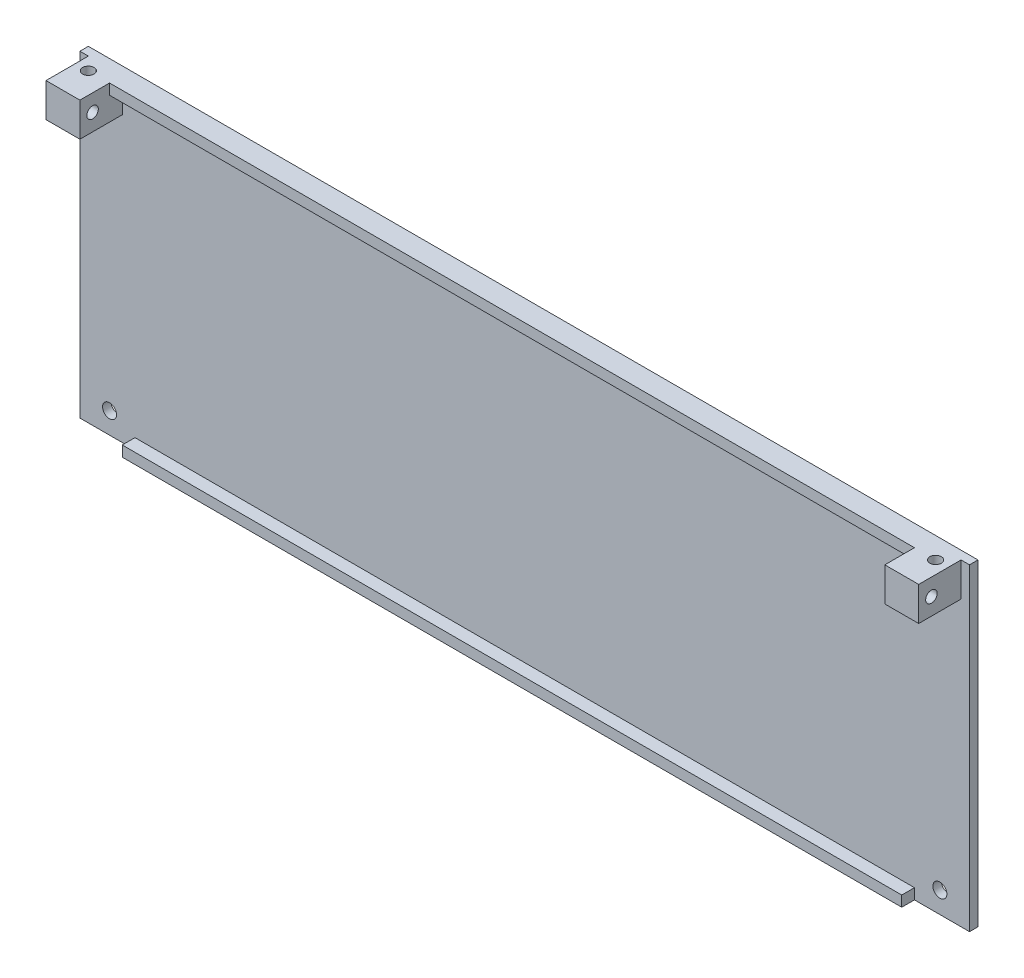
ISO-10303-21;
HEADER;
FILE_DESCRIPTION(('STEP AP214'),'2;1');
FILE_NAME('part.step','',(''),(''),'','','');
FILE_SCHEMA(('AUTOMOTIVE_DESIGN { 1 0 10303 214 1 1 1 1 }'));
ENDSEC;
DATA;
#1=APPLICATION_CONTEXT('core data for automotive mechanical design processes');
#2=APPLICATION_PROTOCOL_DEFINITION('international standard','automotive_design',2000,#1);
#3=PRODUCT_CONTEXT('',#1,'mechanical');
#4=PRODUCT('Part','Part','',(#3));
#5=PRODUCT_RELATED_PRODUCT_CATEGORY('part','',(#4));
#6=PRODUCT_DEFINITION_FORMATION('','',#4);
#7=PRODUCT_DEFINITION_CONTEXT('part definition',#1,'design');
#8=PRODUCT_DEFINITION('design','',#6,#7);
#9=PRODUCT_DEFINITION_SHAPE('','',#8);
#10=(LENGTH_UNIT() NAMED_UNIT(*) SI_UNIT(.MILLI.,.METRE.));
#11=(NAMED_UNIT(*) PLANE_ANGLE_UNIT() SI_UNIT($,.RADIAN.));
#12=(NAMED_UNIT(*) SI_UNIT($,.STERADIAN.) SOLID_ANGLE_UNIT());
#13=UNCERTAINTY_MEASURE_WITH_UNIT(LENGTH_MEASURE(1.E-05),#10,'distance_accuracy_value','');
#14=(GEOMETRIC_REPRESENTATION_CONTEXT(3) GLOBAL_UNCERTAINTY_ASSIGNED_CONTEXT((#13)) GLOBAL_UNIT_ASSIGNED_CONTEXT((#10,
#11,#12)) REPRESENTATION_CONTEXT('',''));
#15=CARTESIAN_POINT('',(0.,0.,0.));
#16=DIRECTION('',(0.,0.,1.));
#17=DIRECTION('',(1.,0.,0.));
#18=AXIS2_PLACEMENT_3D('',#15,#16,#17);
#19=CARTESIAN_POINT('',(0.,0.,2.));
#20=DIRECTION('',(0.,0.,1.));
#21=DIRECTION('',(1.,0.,0.));
#22=AXIS2_PLACEMENT_3D('',#19,#20,#21);
#23=PLANE('',#22);
#24=CARTESIAN_POINT('',(-97.9999999999999,-32.5,2.));
#25=DIRECTION('',(0.,0.,1.));
#26=DIRECTION('',(1.,0.,0.));
#27=AXIS2_PLACEMENT_3D('',#24,#25,#26);
#28=CIRCLE('',#27,1.65);
#29=CARTESIAN_POINT('',(-96.35,-32.5,2.));
#30=VERTEX_POINT('',#29);
#31=EDGE_CURVE('E276',#30,#30,#28,.T.);
#32=ORIENTED_EDGE('',*,*,#31,.F.);
#33=EDGE_LOOP('',(#32));
#34=FACE_BOUND('',#33,.T.);
#35=CARTESIAN_POINT('',(98.0000000000001,-32.5,2.));
#36=DIRECTION('',(0.,0.,1.));
#37=DIRECTION('',(-1.,0.,0.));
#38=AXIS2_PLACEMENT_3D('',#35,#36,#37);
#39=CIRCLE('',#38,1.65);
#40=CARTESIAN_POINT('',(96.3500000000001,-32.5,2.));
#41=VERTEX_POINT('',#40);
#42=EDGE_CURVE('E270',#41,#41,#39,.T.);
#43=ORIENTED_EDGE('',*,*,#42,.F.);
#44=EDGE_LOOP('',(#43));
#45=FACE_BOUND('',#44,.T.);
#46=DIRECTION('',(1.,0.,0.));
#47=VECTOR('',#46,1.);
#48=CARTESIAN_POINT('',(-105.,-37.5,2.));
#49=LINE('',#48,#47);
#50=CARTESIAN_POINT('',(-105.,-37.5,2.));
#51=VERTEX_POINT('',#50);
#52=CARTESIAN_POINT('',(-92.,-37.5,2.));
#53=VERTEX_POINT('',#52);
#54=EDGE_CURVE('E292',#51,#53,#49,.T.);
#55=ORIENTED_EDGE('',*,*,#54,.T.);
#56=DIRECTION('',(0.,-1.,0.));
#57=VECTOR('',#56,1.);
#58=CARTESIAN_POINT('',(-92.,-37.5,2.));
#59=LINE('',#58,#57);
#60=CARTESIAN_POINT('',(-92.,-35.,2.));
#61=VERTEX_POINT('',#60);
#62=EDGE_CURVE('E55',#61,#53,#59,.T.);
#63=ORIENTED_EDGE('',*,*,#62,.F.);
#64=DIRECTION('',(-1.,0.,0.));
#65=VECTOR('',#64,1.);
#66=CARTESIAN_POINT('',(-92.,-35.,2.));
#67=LINE('',#66,#65);
#68=CARTESIAN_POINT('',(92.,-35.,2.));
#69=VERTEX_POINT('',#68);
#70=EDGE_CURVE('E50',#69,#61,#67,.T.);
#71=ORIENTED_EDGE('',*,*,#70,.F.);
#72=DIRECTION('',(0.,1.,0.));
#73=VECTOR('',#72,1.);
#74=CARTESIAN_POINT('',(92.,-37.5,2.));
#75=LINE('',#74,#73);
#76=CARTESIAN_POINT('',(92.,-37.5,2.));
#77=VERTEX_POINT('',#76);
#78=EDGE_CURVE('E382',#77,#69,#75,.T.);
#79=ORIENTED_EDGE('',*,*,#78,.F.);
#80=CARTESIAN_POINT('',(105.,-37.5,2.));
#81=VERTEX_POINT('',#80);
#82=EDGE_CURVE('E291',#77,#81,#49,.T.);
#83=ORIENTED_EDGE('',*,*,#82,.T.);
#84=DIRECTION('',(0.,1.,0.));
#85=VECTOR('',#84,1.);
#86=CARTESIAN_POINT('',(105.,37.5,2.));
#87=LINE('',#86,#85);
#88=CARTESIAN_POINT('',(105.,37.5,2.));
#89=VERTEX_POINT('',#88);
#90=EDGE_CURVE('E282',#81,#89,#87,.T.);
#91=ORIENTED_EDGE('',*,*,#90,.T.);
#92=DIRECTION('',(-1.,0.,0.));
#93=VECTOR('',#92,1.);
#94=CARTESIAN_POINT('',(-105.,37.5,2.));
#95=LINE('',#94,#93);
#96=CARTESIAN_POINT('',(103.,37.5,2.));
#97=VERTEX_POINT('',#96);
#98=EDGE_CURVE('E287',#89,#97,#95,.T.);
#99=ORIENTED_EDGE('',*,*,#98,.T.);
#100=DIRECTION('',(0.,1.,0.));
#101=VECTOR('',#100,1.);
#102=CARTESIAN_POINT('',(103.,37.5,2.));
#103=LINE('',#102,#101);
#104=CARTESIAN_POINT('',(103.,29.5,2.));
#105=VERTEX_POINT('',#104);
#106=EDGE_CURVE('E221',#105,#97,#103,.T.);
#107=ORIENTED_EDGE('',*,*,#106,.F.);
#108=DIRECTION('',(1.,0.,0.));
#109=VECTOR('',#108,1.);
#110=CARTESIAN_POINT('',(103.,29.5,2.));
#111=LINE('',#110,#109);
#112=CARTESIAN_POINT('',(95.,29.5,2.));
#113=VERTEX_POINT('',#112);
#114=EDGE_CURVE('E214',#113,#105,#111,.T.);
#115=ORIENTED_EDGE('',*,*,#114,.F.);
#116=DIRECTION('',(0.,-1.,0.));
#117=VECTOR('',#116,1.);
#118=CARTESIAN_POINT('',(95.,37.5,2.));
#119=LINE('',#118,#117);
#120=CARTESIAN_POINT('',(95.,35.,2.));
#121=VERTEX_POINT('',#120);
#122=EDGE_CURVE('E224',#121,#113,#119,.T.);
#123=ORIENTED_EDGE('',*,*,#122,.F.);
#124=DIRECTION('',(1.,0.,0.));
#125=VECTOR('',#124,1.);
#126=CARTESIAN_POINT('',(-95.,35.,2.));
#127=LINE('',#126,#125);
#128=CARTESIAN_POINT('',(-95.,35.,2.));
#129=VERTEX_POINT('',#128);
#130=EDGE_CURVE('E181',#129,#121,#127,.T.);
#131=ORIENTED_EDGE('',*,*,#130,.F.);
#132=DIRECTION('',(0.,1.,0.));
#133=VECTOR('',#132,1.);
#134=CARTESIAN_POINT('',(-95.,37.5,2.));
#135=LINE('',#134,#133);
#136=CARTESIAN_POINT('',(-95.,29.5,2.));
#137=VERTEX_POINT('',#136);
#138=EDGE_CURVE('E244',#137,#129,#135,.T.);
#139=ORIENTED_EDGE('',*,*,#138,.F.);
#140=DIRECTION('',(1.,0.,0.));
#141=VECTOR('',#140,1.);
#142=CARTESIAN_POINT('',(-103.,29.5,2.));
#143=LINE('',#142,#141);
#144=CARTESIAN_POINT('',(-103.,29.5,2.));
#145=VERTEX_POINT('',#144);
#146=EDGE_CURVE('E253',#145,#137,#143,.T.);
#147=ORIENTED_EDGE('',*,*,#146,.F.);
#148=DIRECTION('',(0.,-1.,0.));
#149=VECTOR('',#148,1.);
#150=CARTESIAN_POINT('',(-103.,37.5,2.));
#151=LINE('',#150,#149);
#152=CARTESIAN_POINT('',(-103.,37.5,2.));
#153=VERTEX_POINT('',#152);
#154=EDGE_CURVE('E239',#153,#145,#151,.T.);
#155=ORIENTED_EDGE('',*,*,#154,.F.);
#156=CARTESIAN_POINT('',(-105.,37.5,2.));
#157=VERTEX_POINT('',#156);
#158=EDGE_CURVE('E285',#153,#157,#95,.T.);
#159=ORIENTED_EDGE('',*,*,#158,.T.);
#160=DIRECTION('',(0.,-1.,0.));
#161=VECTOR('',#160,1.);
#162=CARTESIAN_POINT('',(-105.,37.5,2.));
#163=LINE('',#162,#161);
#164=EDGE_CURVE('E289',#157,#51,#163,.T.);
#165=ORIENTED_EDGE('',*,*,#164,.T.);
#166=EDGE_LOOP('',(#55,#63,#71,#79,#83,#91,#99,#107,#115,#123,#131,#139,#147,#155,#159,#165));
#167=FACE_BOUND('',#166,.T.);
#168=ADVANCED_FACE('F33',(#34,#45,#167),#23,.T.);
#169=CARTESIAN_POINT('',(-95.,37.5,12.));
#170=DIRECTION('',(-1.,0.,0.));
#171=DIRECTION('',(0.,0.,1.));
#172=AXIS2_PLACEMENT_3D('',#169,#170,#171);
#173=PLANE('',#172);
#174=CARTESIAN_POINT('',(-95.,33.5,9.));
#175=DIRECTION('',(-1.,0.,0.));
#176=DIRECTION('',(0.,0.,1.));
#177=AXIS2_PLACEMENT_3D('',#174,#175,#176);
#178=CIRCLE('',#177,1.35);
#179=CARTESIAN_POINT('',(-95.,33.5,10.35));
#180=VERTEX_POINT('',#179);
#181=EDGE_CURVE('E392',#180,#180,#178,.T.);
#182=ORIENTED_EDGE('',*,*,#181,.T.);
#183=EDGE_LOOP('',(#182));
#184=FACE_BOUND('',#183,.T.);
#185=DIRECTION('',(0.,0.,-1.));
#186=VECTOR('',#185,1.);
#187=CARTESIAN_POINT('',(-95.,35.,5.));
#188=LINE('',#187,#186);
#189=CARTESIAN_POINT('',(-95.,35.,5.));
#190=VERTEX_POINT('',#189);
#191=EDGE_CURVE('E201',#190,#129,#188,.T.);
#192=ORIENTED_EDGE('',*,*,#191,.F.);
#193=DIRECTION('',(0.,-1.,0.));
#194=VECTOR('',#193,1.);
#195=CARTESIAN_POINT('',(-95.,37.5,5.));
#196=LINE('',#195,#194);
#197=CARTESIAN_POINT('',(-95.,37.5,5.));
#198=VERTEX_POINT('',#197);
#199=EDGE_CURVE('E193',#198,#190,#196,.T.);
#200=ORIENTED_EDGE('',*,*,#199,.F.);
#201=DIRECTION('',(0.,0.,-1.));
#202=VECTOR('',#201,1.);
#203=CARTESIAN_POINT('',(-95.,37.5,12.));
#204=LINE('',#203,#202);
#205=CARTESIAN_POINT('',(-95.,37.5,12.));
#206=VERTEX_POINT('',#205);
#207=EDGE_CURVE('E260',#206,#198,#204,.T.);
#208=ORIENTED_EDGE('',*,*,#207,.F.);
#209=DIRECTION('',(0.,1.,0.));
#210=VECTOR('',#209,1.);
#211=CARTESIAN_POINT('',(-95.,37.5,12.));
#212=LINE('',#211,#210);
#213=CARTESIAN_POINT('',(-95.,29.5,12.));
#214=VERTEX_POINT('',#213);
#215=EDGE_CURVE('E246',#214,#206,#212,.T.);
#216=ORIENTED_EDGE('',*,*,#215,.F.);
#217=DIRECTION('',(0.,0.,-1.));
#218=VECTOR('',#217,1.);
#219=CARTESIAN_POINT('',(-95.,29.5,12.));
#220=LINE('',#219,#218);
#221=EDGE_CURVE('E263',#214,#137,#220,.T.);
#222=ORIENTED_EDGE('',*,*,#221,.T.);
#223=ORIENTED_EDGE('',*,*,#138,.T.);
#224=EDGE_LOOP('',(#192,#200,#208,#216,#222,#223));
#225=FACE_BOUND('',#224,.T.);
#226=ADVANCED_FACE('F334',(#184,#225),#173,.F.);
#227=CARTESIAN_POINT('',(95.,37.5,12.));
#228=DIRECTION('',(1.,0.,0.));
#229=DIRECTION('',(0.,0.,-1.));
#230=AXIS2_PLACEMENT_3D('',#227,#228,#229);
#231=PLANE('',#230);
#232=CARTESIAN_POINT('',(95.,33.5,9.));
#233=DIRECTION('',(1.,0.,0.));
#234=DIRECTION('',(0.,0.,-1.));
#235=AXIS2_PLACEMENT_3D('',#232,#233,#234);
#236=CIRCLE('',#235,1.35);
#237=CARTESIAN_POINT('',(95.,33.5,7.65));
#238=VERTEX_POINT('',#237);
#239=EDGE_CURVE('E633',#238,#238,#236,.T.);
#240=ORIENTED_EDGE('',*,*,#239,.T.);
#241=EDGE_LOOP('',(#240));
#242=FACE_BOUND('',#241,.T.);
#243=DIRECTION('',(0.,0.,-1.));
#244=VECTOR('',#243,1.);
#245=CARTESIAN_POINT('',(95.,35.,5.));
#246=LINE('',#245,#244);
#247=CARTESIAN_POINT('',(95.,35.,5.));
#248=VERTEX_POINT('',#247);
#249=EDGE_CURVE('E197',#248,#121,#246,.T.);
#250=ORIENTED_EDGE('',*,*,#249,.T.);
#251=ORIENTED_EDGE('',*,*,#122,.T.);
#252=DIRECTION('',(0.,0.,-1.));
#253=VECTOR('',#252,1.);
#254=CARTESIAN_POINT('',(95.,29.5,12.));
#255=LINE('',#254,#253);
#256=CARTESIAN_POINT('',(95.,29.5,12.));
#257=VERTEX_POINT('',#256);
#258=EDGE_CURVE('E230',#257,#113,#255,.T.);
#259=ORIENTED_EDGE('',*,*,#258,.F.);
#260=DIRECTION('',(0.,-1.,0.));
#261=VECTOR('',#260,1.);
#262=CARTESIAN_POINT('',(95.,37.5,12.));
#263=LINE('',#262,#261);
#264=CARTESIAN_POINT('',(95.,37.5,12.));
#265=VERTEX_POINT('',#264);
#266=EDGE_CURVE('E216',#265,#257,#263,.T.);
#267=ORIENTED_EDGE('',*,*,#266,.F.);
#268=DIRECTION('',(0.,0.,-1.));
#269=VECTOR('',#268,1.);
#270=CARTESIAN_POINT('',(95.,37.5,12.));
#271=LINE('',#270,#269);
#272=CARTESIAN_POINT('',(95.,37.5,5.));
#273=VERTEX_POINT('',#272);
#274=EDGE_CURVE('E233',#265,#273,#271,.T.);
#275=ORIENTED_EDGE('',*,*,#274,.T.);
#276=DIRECTION('',(0.,1.,0.));
#277=VECTOR('',#276,1.);
#278=CARTESIAN_POINT('',(95.,35.,5.));
#279=LINE('',#278,#277);
#280=EDGE_CURVE('E183',#248,#273,#279,.T.);
#281=ORIENTED_EDGE('',*,*,#280,.F.);
#282=EDGE_LOOP('',(#250,#251,#259,#267,#275,#281));
#283=FACE_BOUND('',#282,.T.);
#284=ADVANCED_FACE('F342',(#242,#283),#231,.F.);
#285=CARTESIAN_POINT('',(0.,0.,0.));
#286=DIRECTION('',(0.,0.,1.));
#287=DIRECTION('',(1.,0.,0.));
#288=AXIS2_PLACEMENT_3D('',#285,#286,#287);
#289=PLANE('',#288);
#290=DIRECTION('',(0.,1.,0.));
#291=VECTOR('',#290,1.);
#292=CARTESIAN_POINT('',(105.,37.5,0.));
#293=LINE('',#292,#291);
#294=CARTESIAN_POINT('',(105.,-37.5,0.));
#295=VERTEX_POINT('',#294);
#296=CARTESIAN_POINT('',(105.,37.5,0.));
#297=VERTEX_POINT('',#296);
#298=EDGE_CURVE('E279',#295,#297,#293,.T.);
#299=ORIENTED_EDGE('',*,*,#298,.F.);
#300=DIRECTION('',(1.,0.,0.));
#301=VECTOR('',#300,1.);
#302=CARTESIAN_POINT('',(-105.,-37.5,0.));
#303=LINE('',#302,#301);
#304=CARTESIAN_POINT('',(-105.,-37.5,0.));
#305=VERTEX_POINT('',#304);
#306=EDGE_CURVE('E286',#305,#295,#303,.T.);
#307=ORIENTED_EDGE('',*,*,#306,.F.);
#308=DIRECTION('',(0.,-1.,0.));
#309=VECTOR('',#308,1.);
#310=CARTESIAN_POINT('',(-105.,37.5,0.));
#311=LINE('',#310,#309);
#312=CARTESIAN_POINT('',(-105.,37.5,0.));
#313=VERTEX_POINT('',#312);
#314=EDGE_CURVE('E299',#313,#305,#311,.T.);
#315=ORIENTED_EDGE('',*,*,#314,.F.);
#316=DIRECTION('',(-1.,0.,0.));
#317=VECTOR('',#316,1.);
#318=CARTESIAN_POINT('',(-105.,37.5,0.));
#319=LINE('',#318,#317);
#320=EDGE_CURVE('E297',#297,#313,#319,.T.);
#321=ORIENTED_EDGE('',*,*,#320,.F.);
#322=EDGE_LOOP('',(#299,#307,#315,#321));
#323=FACE_BOUND('',#322,.T.);
#324=CARTESIAN_POINT('',(-97.9999999999999,-32.5,0.));
#325=DIRECTION('',(0.,0.,1.));
#326=DIRECTION('',(1.,0.,0.));
#327=AXIS2_PLACEMENT_3D('',#324,#325,#326);
#328=CIRCLE('',#327,1.65);
#329=CARTESIAN_POINT('',(-96.35,-32.5,0.));
#330=VERTEX_POINT('',#329);
#331=EDGE_CURVE('E273',#330,#330,#328,.T.);
#332=ORIENTED_EDGE('',*,*,#331,.T.);
#333=EDGE_LOOP('',(#332));
#334=FACE_BOUND('',#333,.T.);
#335=CARTESIAN_POINT('',(98.0000000000001,-32.5,0.));
#336=DIRECTION('',(0.,0.,1.));
#337=DIRECTION('',(-1.,0.,0.));
#338=AXIS2_PLACEMENT_3D('',#335,#336,#337);
#339=CIRCLE('',#338,1.65);
#340=CARTESIAN_POINT('',(96.3500000000001,-32.5,0.));
#341=VERTEX_POINT('',#340);
#342=EDGE_CURVE('E269',#341,#341,#339,.T.);
#343=ORIENTED_EDGE('',*,*,#342,.T.);
#344=EDGE_LOOP('',(#343));
#345=FACE_BOUND('',#344,.T.);
#346=ADVANCED_FACE('F351',(#323,#334,#345),#289,.F.);
#347=CARTESIAN_POINT('',(105.,37.5,2.));
#348=DIRECTION('',(-1.,0.,0.));
#349=DIRECTION('',(0.,-1.,0.));
#350=AXIS2_PLACEMENT_3D('',#347,#348,#349);
#351=PLANE('',#350);
#352=ORIENTED_EDGE('',*,*,#298,.T.);
#353=DIRECTION('',(0.,0.,-1.));
#354=VECTOR('',#353,1.);
#355=CARTESIAN_POINT('',(105.,37.5,2.));
#356=LINE('',#355,#354);
#357=EDGE_CURVE('E11',#89,#297,#356,.T.);
#358=ORIENTED_EDGE('',*,*,#357,.F.);
#359=ORIENTED_EDGE('',*,*,#90,.F.);
#360=DIRECTION('',(0.,0.,-1.));
#361=VECTOR('',#360,1.);
#362=CARTESIAN_POINT('',(105.,-37.5,2.));
#363=LINE('',#362,#361);
#364=EDGE_CURVE('E294',#81,#295,#363,.T.);
#365=ORIENTED_EDGE('',*,*,#364,.T.);
#366=EDGE_LOOP('',(#352,#358,#359,#365));
#367=FACE_BOUND('',#366,.T.);
#368=ADVANCED_FACE('F35',(#367),#351,.F.);
#369=CARTESIAN_POINT('',(-105.,37.5,2.));
#370=DIRECTION('',(0.,-1.,0.));
#371=DIRECTION('',(0.,0.,-1.));
#372=AXIS2_PLACEMENT_3D('',#369,#370,#371);
#373=PLANE('',#372);
#374=CARTESIAN_POINT('',(-100.,37.5,5.));
#375=DIRECTION('',(0.,1.,0.));
#376=DIRECTION('',(0.,0.,1.));
#377=AXIS2_PLACEMENT_3D('',#374,#375,#376);
#378=CIRCLE('',#377,1.35000000000001);
#379=CARTESIAN_POINT('',(-100.,37.5,6.35000000000001));
#380=VERTEX_POINT('',#379);
#381=EDGE_CURVE('E204',#380,#380,#378,.T.);
#382=ORIENTED_EDGE('',*,*,#381,.F.);
#383=EDGE_LOOP('',(#382));
#384=FACE_BOUND('',#383,.T.);
#385=CARTESIAN_POINT('',(100.,37.5,5.));
#386=DIRECTION('',(0.,1.,0.));
#387=DIRECTION('',(0.,0.,-1.));
#388=AXIS2_PLACEMENT_3D('',#385,#386,#387);
#389=CIRCLE('',#388,1.35000000000001);
#390=CARTESIAN_POINT('',(100.,37.5,3.64999999999999));
#391=VERTEX_POINT('',#390);
#392=EDGE_CURVE('E203',#391,#391,#389,.T.);
#393=ORIENTED_EDGE('',*,*,#392,.F.);
#394=EDGE_LOOP('',(#393));
#395=FACE_BOUND('',#394,.T.);
#396=ORIENTED_EDGE('',*,*,#320,.T.);
#397=DIRECTION('',(0.,0.,-1.));
#398=VECTOR('',#397,1.);
#399=CARTESIAN_POINT('',(-105.,37.5,2.));
#400=LINE('',#399,#398);
#401=EDGE_CURVE('E42',#157,#313,#400,.T.);
#402=ORIENTED_EDGE('',*,*,#401,.F.);
#403=ORIENTED_EDGE('',*,*,#158,.F.);
#404=DIRECTION('',(0.,0.,-1.));
#405=VECTOR('',#404,1.);
#406=CARTESIAN_POINT('',(-103.,37.5,12.));
#407=LINE('',#406,#405);
#408=CARTESIAN_POINT('',(-103.,37.5,12.));
#409=VERTEX_POINT('',#408);
#410=EDGE_CURVE('E250',#409,#153,#407,.T.);
#411=ORIENTED_EDGE('',*,*,#410,.F.);
#412=DIRECTION('',(-1.,0.,0.));
#413=VECTOR('',#412,1.);
#414=CARTESIAN_POINT('',(-103.,37.5,12.));
#415=LINE('',#414,#413);
#416=EDGE_CURVE('E248',#206,#409,#415,.T.);
#417=ORIENTED_EDGE('',*,*,#416,.F.);
#418=ORIENTED_EDGE('',*,*,#207,.T.);
#419=DIRECTION('',(-1.,0.,0.));
#420=VECTOR('',#419,1.);
#421=CARTESIAN_POINT('',(95.,37.5,5.));
#422=LINE('',#421,#420);
#423=EDGE_CURVE('E191',#273,#198,#422,.T.);
#424=ORIENTED_EDGE('',*,*,#423,.F.);
#425=ORIENTED_EDGE('',*,*,#274,.F.);
#426=DIRECTION('',(-1.,0.,0.));
#427=VECTOR('',#426,1.);
#428=CARTESIAN_POINT('',(103.,37.5,12.));
#429=LINE('',#428,#427);
#430=CARTESIAN_POINT('',(103.,37.5,12.));
#431=VERTEX_POINT('',#430);
#432=EDGE_CURVE('E213',#431,#265,#429,.T.);
#433=ORIENTED_EDGE('',*,*,#432,.F.);
#434=DIRECTION('',(0.,0.,-1.));
#435=VECTOR('',#434,1.);
#436=CARTESIAN_POINT('',(103.,37.5,12.));
#437=LINE('',#436,#435);
#438=EDGE_CURVE('E236',#431,#97,#437,.T.);
#439=ORIENTED_EDGE('',*,*,#438,.T.);
#440=ORIENTED_EDGE('',*,*,#98,.F.);
#441=ORIENTED_EDGE('',*,*,#357,.T.);
#442=EDGE_LOOP('',(#396,#402,#403,#411,#417,#418,#424,#425,#433,#439,#440,#441));
#443=FACE_BOUND('',#442,.T.);
#444=ADVANCED_FACE('F359',(#384,#395,#443),#373,.F.);
#445=CARTESIAN_POINT('',(-105.,37.5,2.));
#446=DIRECTION('',(1.,0.,0.));
#447=DIRECTION('',(0.,1.,0.));
#448=AXIS2_PLACEMENT_3D('',#445,#446,#447);
#449=PLANE('',#448);
#450=ORIENTED_EDGE('',*,*,#314,.T.);
#451=DIRECTION('',(0.,0.,-1.));
#452=VECTOR('',#451,1.);
#453=CARTESIAN_POINT('',(-105.,-37.5,2.));
#454=LINE('',#453,#452);
#455=EDGE_CURVE('E304',#51,#305,#454,.T.);
#456=ORIENTED_EDGE('',*,*,#455,.F.);
#457=ORIENTED_EDGE('',*,*,#164,.F.);
#458=ORIENTED_EDGE('',*,*,#401,.T.);
#459=EDGE_LOOP('',(#450,#456,#457,#458));
#460=FACE_BOUND('',#459,.T.);
#461=ADVANCED_FACE('F357',(#460),#449,.F.);
#462=CARTESIAN_POINT('',(-105.,-37.5,2.));
#463=DIRECTION('',(0.,1.,0.));
#464=DIRECTION('',(0.,0.,1.));
#465=AXIS2_PLACEMENT_3D('',#462,#463,#464);
#466=PLANE('',#465);
#467=ORIENTED_EDGE('',*,*,#306,.T.);
#468=ORIENTED_EDGE('',*,*,#364,.F.);
#469=ORIENTED_EDGE('',*,*,#82,.F.);
#470=DIRECTION('',(0.,0.,-1.));
#471=VECTOR('',#470,1.);
#472=CARTESIAN_POINT('',(92.,-37.5,5.));
#473=LINE('',#472,#471);
#474=CARTESIAN_POINT('',(92.,-37.5,5.));
#475=VERTEX_POINT('',#474);
#476=EDGE_CURVE('E166',#475,#77,#473,.T.);
#477=ORIENTED_EDGE('',*,*,#476,.F.);
#478=DIRECTION('',(1.,0.,0.));
#479=VECTOR('',#478,1.);
#480=CARTESIAN_POINT('',(-92.,-37.5,5.));
#481=LINE('',#480,#479);
#482=CARTESIAN_POINT('',(-92.,-37.5,5.));
#483=VERTEX_POINT('',#482);
#484=EDGE_CURVE('E159',#483,#475,#481,.T.);
#485=ORIENTED_EDGE('',*,*,#484,.F.);
#486=DIRECTION('',(0.,0.,-1.));
#487=VECTOR('',#486,1.);
#488=CARTESIAN_POINT('',(-92.,-37.5,5.));
#489=LINE('',#488,#487);
#490=EDGE_CURVE('E164',#483,#53,#489,.T.);
#491=ORIENTED_EDGE('',*,*,#490,.T.);
#492=ORIENTED_EDGE('',*,*,#54,.F.);
#493=ORIENTED_EDGE('',*,*,#455,.T.);
#494=EDGE_LOOP('',(#467,#468,#469,#477,#485,#491,#492,#493));
#495=FACE_BOUND('',#494,.T.);
#496=ADVANCED_FACE('F161',(#495),#466,.F.);
#497=CARTESIAN_POINT('',(-97.9999999999999,-32.5,2.));
#498=DIRECTION('',(0.,0.,-1.));
#499=DIRECTION('',(-1.,0.,0.));
#500=AXIS2_PLACEMENT_3D('',#497,#498,#499);
#501=CYLINDRICAL_SURFACE('',#500,1.65);
#502=ORIENTED_EDGE('',*,*,#31,.T.);
#503=EDGE_LOOP('',(#502));
#504=FACE_BOUND('',#503,.T.);
#505=ORIENTED_EDGE('',*,*,#331,.F.);
#506=EDGE_LOOP('',(#505));
#507=FACE_BOUND('',#506,.T.);
#508=ADVANCED_FACE('F349',(#504,#507),#501,.F.);
#509=CARTESIAN_POINT('',(98.0000000000001,-32.5,2.));
#510=DIRECTION('',(0.,0.,-1.));
#511=DIRECTION('',(-1.,0.,0.));
#512=AXIS2_PLACEMENT_3D('',#509,#510,#511);
#513=CYLINDRICAL_SURFACE('',#512,1.65);
#514=ORIENTED_EDGE('',*,*,#42,.T.);
#515=EDGE_LOOP('',(#514));
#516=FACE_BOUND('',#515,.T.);
#517=ORIENTED_EDGE('',*,*,#342,.F.);
#518=EDGE_LOOP('',(#517));
#519=FACE_BOUND('',#518,.T.);
#520=ADVANCED_FACE('F457',(#516,#519),#513,.F.);
#521=CARTESIAN_POINT('',(-103.,37.5,12.));
#522=DIRECTION('',(1.,0.,0.));
#523=DIRECTION('',(0.,0.,-1.));
#524=AXIS2_PLACEMENT_3D('',#521,#522,#523);
#525=PLANE('',#524);
#526=CARTESIAN_POINT('',(-103.,33.5,9.));
#527=DIRECTION('',(1.,0.,0.));
#528=DIRECTION('',(0.,0.,-1.));
#529=AXIS2_PLACEMENT_3D('',#526,#527,#528);
#530=CIRCLE('',#529,1.35);
#531=CARTESIAN_POINT('',(-103.,33.5,7.65));
#532=VERTEX_POINT('',#531);
#533=EDGE_CURVE('E630',#532,#532,#530,.T.);
#534=ORIENTED_EDGE('',*,*,#533,.T.);
#535=EDGE_LOOP('',(#534));
#536=FACE_BOUND('',#535,.T.);
#537=ORIENTED_EDGE('',*,*,#154,.T.);
#538=DIRECTION('',(0.,0.,-1.));
#539=VECTOR('',#538,1.);
#540=CARTESIAN_POINT('',(-103.,29.5,12.));
#541=LINE('',#540,#539);
#542=CARTESIAN_POINT('',(-103.,29.5,12.));
#543=VERTEX_POINT('',#542);
#544=EDGE_CURVE('E266',#543,#145,#541,.T.);
#545=ORIENTED_EDGE('',*,*,#544,.F.);
#546=DIRECTION('',(0.,-1.,0.));
#547=VECTOR('',#546,1.);
#548=CARTESIAN_POINT('',(-103.,37.5,12.));
#549=LINE('',#548,#547);
#550=EDGE_CURVE('E240',#409,#543,#549,.T.);
#551=ORIENTED_EDGE('',*,*,#550,.F.);
#552=ORIENTED_EDGE('',*,*,#410,.T.);
#553=EDGE_LOOP('',(#537,#545,#551,#552));
#554=FACE_BOUND('',#553,.T.);
#555=ADVANCED_FACE('F456',(#536,#554),#525,.F.);
#556=CARTESIAN_POINT('',(-103.,29.5,12.));
#557=DIRECTION('',(0.,1.,0.));
#558=DIRECTION('',(0.,0.,1.));
#559=AXIS2_PLACEMENT_3D('',#556,#557,#558);
#560=PLANE('',#559);
#561=CARTESIAN_POINT('',(-100.,29.5,5.));
#562=DIRECTION('',(0.,1.,0.));
#563=DIRECTION('',(0.,0.,1.));
#564=AXIS2_PLACEMENT_3D('',#561,#562,#563);
#565=CIRCLE('',#564,1.35000000000001);
#566=CARTESIAN_POINT('',(-100.,29.5,6.35000000000001));
#567=VERTEX_POINT('',#566);
#568=EDGE_CURVE('E37',#567,#567,#565,.T.);
#569=ORIENTED_EDGE('',*,*,#568,.T.);
#570=EDGE_LOOP('',(#569));
#571=FACE_BOUND('',#570,.T.);
#572=ORIENTED_EDGE('',*,*,#146,.T.);
#573=ORIENTED_EDGE('',*,*,#221,.F.);
#574=DIRECTION('',(1.,0.,0.));
#575=VECTOR('',#574,1.);
#576=CARTESIAN_POINT('',(-103.,29.5,12.));
#577=LINE('',#576,#575);
#578=EDGE_CURVE('E243',#543,#214,#577,.T.);
#579=ORIENTED_EDGE('',*,*,#578,.F.);
#580=ORIENTED_EDGE('',*,*,#544,.T.);
#581=EDGE_LOOP('',(#572,#573,#579,#580));
#582=FACE_BOUND('',#581,.T.);
#583=ADVANCED_FACE('F314',(#571,#582),#560,.F.);
#584=CARTESIAN_POINT('',(0.,0.,12.));
#585=DIRECTION('',(0.,0.,1.));
#586=DIRECTION('',(1.,0.,0.));
#587=AXIS2_PLACEMENT_3D('',#584,#585,#586);
#588=PLANE('',#587);
#589=ORIENTED_EDGE('',*,*,#550,.T.);
#590=ORIENTED_EDGE('',*,*,#578,.T.);
#591=ORIENTED_EDGE('',*,*,#215,.T.);
#592=ORIENTED_EDGE('',*,*,#416,.T.);
#593=EDGE_LOOP('',(#589,#590,#591,#592));
#594=FACE_BOUND('',#593,.T.);
#595=ADVANCED_FACE('F439',(#594),#588,.T.);
#596=CARTESIAN_POINT('',(103.,37.5,12.));
#597=DIRECTION('',(-1.,0.,0.));
#598=DIRECTION('',(0.,0.,1.));
#599=AXIS2_PLACEMENT_3D('',#596,#597,#598);
#600=PLANE('',#599);
#601=CARTESIAN_POINT('',(103.,33.5,9.));
#602=DIRECTION('',(1.,0.,0.));
#603=DIRECTION('',(0.,0.,-1.));
#604=AXIS2_PLACEMENT_3D('',#601,#602,#603);
#605=CIRCLE('',#604,1.35);
#606=CARTESIAN_POINT('',(103.,33.5,7.65));
#607=VERTEX_POINT('',#606);
#608=EDGE_CURVE('E639',#607,#607,#605,.T.);
#609=ORIENTED_EDGE('',*,*,#608,.F.);
#610=EDGE_LOOP('',(#609));
#611=FACE_BOUND('',#610,.T.);
#612=ORIENTED_EDGE('',*,*,#106,.T.);
#613=ORIENTED_EDGE('',*,*,#438,.F.);
#614=DIRECTION('',(0.,1.,0.));
#615=VECTOR('',#614,1.);
#616=CARTESIAN_POINT('',(103.,37.5,12.));
#617=LINE('',#616,#615);
#618=CARTESIAN_POINT('',(103.,29.5,12.));
#619=VERTEX_POINT('',#618);
#620=EDGE_CURVE('E210',#619,#431,#617,.T.);
#621=ORIENTED_EDGE('',*,*,#620,.F.);
#622=DIRECTION('',(0.,0.,-1.));
#623=VECTOR('',#622,1.);
#624=CARTESIAN_POINT('',(103.,29.5,12.));
#625=LINE('',#624,#623);
#626=EDGE_CURVE('E220',#619,#105,#625,.T.);
#627=ORIENTED_EDGE('',*,*,#626,.T.);
#628=EDGE_LOOP('',(#612,#613,#621,#627));
#629=FACE_BOUND('',#628,.T.);
#630=ADVANCED_FACE('F437',(#611,#629),#600,.F.);
#631=CARTESIAN_POINT('',(103.,29.5,12.));
#632=DIRECTION('',(0.,1.,0.));
#633=DIRECTION('',(0.,0.,1.));
#634=AXIS2_PLACEMENT_3D('',#631,#632,#633);
#635=PLANE('',#634);
#636=CARTESIAN_POINT('',(100.,29.5,5.));
#637=DIRECTION('',(0.,1.,0.));
#638=DIRECTION('',(0.,0.,1.));
#639=AXIS2_PLACEMENT_3D('',#636,#637,#638);
#640=CIRCLE('',#639,1.35000000000001);
#641=CARTESIAN_POINT('',(100.,29.5,6.35000000000001));
#642=VERTEX_POINT('',#641);
#643=EDGE_CURVE('E207',#642,#642,#640,.T.);
#644=ORIENTED_EDGE('',*,*,#643,.T.);
#645=EDGE_LOOP('',(#644));
#646=FACE_BOUND('',#645,.T.);
#647=ORIENTED_EDGE('',*,*,#114,.T.);
#648=ORIENTED_EDGE('',*,*,#626,.F.);
#649=DIRECTION('',(1.,0.,0.));
#650=VECTOR('',#649,1.);
#651=CARTESIAN_POINT('',(103.,29.5,12.));
#652=LINE('',#651,#650);
#653=EDGE_CURVE('E218',#257,#619,#652,.T.);
#654=ORIENTED_EDGE('',*,*,#653,.F.);
#655=ORIENTED_EDGE('',*,*,#258,.T.);
#656=EDGE_LOOP('',(#647,#648,#654,#655));
#657=FACE_BOUND('',#656,.T.);
#658=ADVANCED_FACE('F432',(#646,#657),#635,.F.);
#659=CARTESIAN_POINT('',(0.,0.,12.));
#660=DIRECTION('',(0.,0.,-1.));
#661=DIRECTION('',(-1.,0.,0.));
#662=AXIS2_PLACEMENT_3D('',#659,#660,#661);
#663=PLANE('',#662);
#664=ORIENTED_EDGE('',*,*,#620,.T.);
#665=ORIENTED_EDGE('',*,*,#432,.T.);
#666=ORIENTED_EDGE('',*,*,#266,.T.);
#667=ORIENTED_EDGE('',*,*,#653,.T.);
#668=EDGE_LOOP('',(#664,#665,#666,#667));
#669=FACE_BOUND('',#668,.T.);
#670=ADVANCED_FACE('F330',(#669),#663,.F.);
#671=CARTESIAN_POINT('',(100.,27.5,5.));
#672=DIRECTION('',(0.,1.,0.));
#673=DIRECTION('',(0.,0.,1.));
#674=AXIS2_PLACEMENT_3D('',#671,#672,#673);
#675=CYLINDRICAL_SURFACE('',#674,1.35000000000001);
#676=ORIENTED_EDGE('',*,*,#392,.T.);
#677=EDGE_LOOP('',(#676));
#678=FACE_BOUND('',#677,.T.);
#679=ORIENTED_EDGE('',*,*,#643,.F.);
#680=EDGE_LOOP('',(#679));
#681=FACE_BOUND('',#680,.T.);
#682=ADVANCED_FACE('F320',(#678,#681),#675,.F.);
#683=CARTESIAN_POINT('',(-100.,27.5,5.));
#684=DIRECTION('',(0.,1.,0.));
#685=DIRECTION('',(0.,0.,1.));
#686=AXIS2_PLACEMENT_3D('',#683,#684,#685);
#687=CYLINDRICAL_SURFACE('',#686,1.35000000000001);
#688=ORIENTED_EDGE('',*,*,#381,.T.);
#689=EDGE_LOOP('',(#688));
#690=FACE_BOUND('',#689,.T.);
#691=ORIENTED_EDGE('',*,*,#568,.F.);
#692=EDGE_LOOP('',(#691));
#693=FACE_BOUND('',#692,.T.);
#694=ADVANCED_FACE('F317',(#690,#693),#687,.F.);
#695=CARTESIAN_POINT('',(-95.,35.,5.));
#696=DIRECTION('',(0.,1.,0.));
#697=DIRECTION('',(0.,0.,1.));
#698=AXIS2_PLACEMENT_3D('',#695,#696,#697);
#699=PLANE('',#698);
#700=ORIENTED_EDGE('',*,*,#130,.T.);
#701=ORIENTED_EDGE('',*,*,#249,.F.);
#702=DIRECTION('',(1.,0.,0.));
#703=VECTOR('',#702,1.);
#704=CARTESIAN_POINT('',(-95.,35.,5.));
#705=LINE('',#704,#703);
#706=EDGE_CURVE('E195',#190,#248,#705,.T.);
#707=ORIENTED_EDGE('',*,*,#706,.F.);
#708=ORIENTED_EDGE('',*,*,#191,.T.);
#709=EDGE_LOOP('',(#700,#701,#707,#708));
#710=FACE_BOUND('',#709,.T.);
#711=ADVANCED_FACE('F319',(#710),#699,.F.);
#712=CARTESIAN_POINT('',(0.,0.,5.));
#713=DIRECTION('',(0.,0.,1.));
#714=DIRECTION('',(1.,0.,0.));
#715=AXIS2_PLACEMENT_3D('',#712,#713,#714);
#716=PLANE('',#715);
#717=ORIENTED_EDGE('',*,*,#280,.T.);
#718=ORIENTED_EDGE('',*,*,#423,.T.);
#719=ORIENTED_EDGE('',*,*,#199,.T.);
#720=ORIENTED_EDGE('',*,*,#706,.T.);
#721=EDGE_LOOP('',(#717,#718,#719,#720));
#722=FACE_BOUND('',#721,.T.);
#723=ADVANCED_FACE('F327',(#722),#716,.T.);
#724=CARTESIAN_POINT('',(-92.,-37.5,5.));
#725=DIRECTION('',(1.,0.,0.));
#726=DIRECTION('',(0.,0.,-1.));
#727=AXIS2_PLACEMENT_3D('',#724,#725,#726);
#728=PLANE('',#727);
#729=ORIENTED_EDGE('',*,*,#62,.T.);
#730=ORIENTED_EDGE('',*,*,#490,.F.);
#731=DIRECTION('',(0.,-1.,0.));
#732=VECTOR('',#731,1.);
#733=CARTESIAN_POINT('',(-92.,-37.5,5.));
#734=LINE('',#733,#732);
#735=CARTESIAN_POINT('',(-92.,-35.,5.));
#736=VERTEX_POINT('',#735);
#737=EDGE_CURVE('E170',#736,#483,#734,.T.);
#738=ORIENTED_EDGE('',*,*,#737,.F.);
#739=DIRECTION('',(0.,0.,-1.));
#740=VECTOR('',#739,1.);
#741=CARTESIAN_POINT('',(-92.,-35.,5.));
#742=LINE('',#741,#740);
#743=EDGE_CURVE('E389',#736,#61,#742,.T.);
#744=ORIENTED_EDGE('',*,*,#743,.T.);
#745=EDGE_LOOP('',(#729,#730,#738,#744));
#746=FACE_BOUND('',#745,.T.);
#747=ADVANCED_FACE('F180',(#746),#728,.F.);
#748=CARTESIAN_POINT('',(92.,-37.5,5.));
#749=DIRECTION('',(-1.,0.,0.));
#750=DIRECTION('',(0.,0.,1.));
#751=AXIS2_PLACEMENT_3D('',#748,#749,#750);
#752=PLANE('',#751);
#753=ORIENTED_EDGE('',*,*,#78,.T.);
#754=DIRECTION('',(0.,0.,-1.));
#755=VECTOR('',#754,1.);
#756=CARTESIAN_POINT('',(92.,-35.,5.));
#757=LINE('',#756,#755);
#758=CARTESIAN_POINT('',(92.,-35.,5.));
#759=VERTEX_POINT('',#758);
#760=EDGE_CURVE('E185',#759,#69,#757,.T.);
#761=ORIENTED_EDGE('',*,*,#760,.F.);
#762=DIRECTION('',(0.,1.,0.));
#763=VECTOR('',#762,1.);
#764=CARTESIAN_POINT('',(92.,-37.5,5.));
#765=LINE('',#764,#763);
#766=EDGE_CURVE('E169',#475,#759,#765,.T.);
#767=ORIENTED_EDGE('',*,*,#766,.F.);
#768=ORIENTED_EDGE('',*,*,#476,.T.);
#769=EDGE_LOOP('',(#753,#761,#767,#768));
#770=FACE_BOUND('',#769,.T.);
#771=ADVANCED_FACE('F387',(#770),#752,.F.);
#772=CARTESIAN_POINT('',(-92.,-35.,5.));
#773=DIRECTION('',(0.,-1.,0.));
#774=DIRECTION('',(0.,0.,-1.));
#775=AXIS2_PLACEMENT_3D('',#772,#773,#774);
#776=PLANE('',#775);
#777=ORIENTED_EDGE('',*,*,#70,.T.);
#778=ORIENTED_EDGE('',*,*,#743,.F.);
#779=DIRECTION('',(-1.,0.,0.));
#780=VECTOR('',#779,1.);
#781=CARTESIAN_POINT('',(-92.,-35.,5.));
#782=LINE('',#781,#780);
#783=EDGE_CURVE('E175',#759,#736,#782,.T.);
#784=ORIENTED_EDGE('',*,*,#783,.F.);
#785=ORIENTED_EDGE('',*,*,#760,.T.);
#786=EDGE_LOOP('',(#777,#778,#784,#785));
#787=FACE_BOUND('',#786,.T.);
#788=ADVANCED_FACE('F396',(#787),#776,.F.);
#789=CARTESIAN_POINT('',(0.,0.,5.));
#790=DIRECTION('',(0.,0.,-1.));
#791=DIRECTION('',(-1.,0.,0.));
#792=AXIS2_PLACEMENT_3D('',#789,#790,#791);
#793=PLANE('',#792);
#794=ORIENTED_EDGE('',*,*,#737,.T.);
#795=ORIENTED_EDGE('',*,*,#484,.T.);
#796=ORIENTED_EDGE('',*,*,#766,.T.);
#797=ORIENTED_EDGE('',*,*,#783,.T.);
#798=EDGE_LOOP('',(#794,#795,#796,#797));
#799=FACE_BOUND('',#798,.T.);
#800=ADVANCED_FACE('F173',(#799),#793,.F.);
#801=CARTESIAN_POINT('',(-105.,33.5,9.));
#802=DIRECTION('',(1.,0.,0.));
#803=DIRECTION('',(0.,0.,-1.));
#804=AXIS2_PLACEMENT_3D('',#801,#802,#803);
#805=CYLINDRICAL_SURFACE('',#804,1.35);
#806=ORIENTED_EDGE('',*,*,#608,.T.);
#807=EDGE_LOOP('',(#806));
#808=FACE_BOUND('',#807,.T.);
#809=ORIENTED_EDGE('',*,*,#239,.F.);
#810=EDGE_LOOP('',(#809));
#811=FACE_BOUND('',#810,.T.);
#812=ADVANCED_FACE('F403',(#808,#811),#805,.F.);
#813=ORIENTED_EDGE('',*,*,#533,.F.);
#814=EDGE_LOOP('',(#813));
#815=FACE_BOUND('',#814,.T.);
#816=ORIENTED_EDGE('',*,*,#181,.F.);
#817=EDGE_LOOP('',(#816));
#818=FACE_BOUND('',#817,.T.);
#819=ADVANCED_FACE('F615',(#815,#818),#805,.F.);
#820=CLOSED_SHELL('',(#168,#226,#284,#346,#368,#444,#461,#496,#508,#520,#555,#583,#595,#630,
#658,#670,#682,#694,#711,#723,#747,#771,#788,#800,#812,#819));
#821=MANIFOLD_SOLID_BREP('B2',#820);
#822=ADVANCED_BREP_SHAPE_REPRESENTATION('',(#18,#821),#14);
#823=SHAPE_DEFINITION_REPRESENTATION(#9,#822);
ENDSEC;
END-ISO-10303-21;
